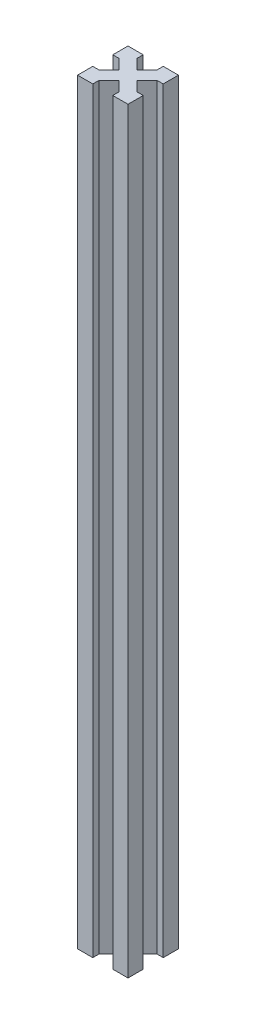
ISO-10303-21;
HEADER;
FILE_DESCRIPTION(('STEP AP214'),'2;1');
FILE_NAME('part.step','',(''),(''),'','','');
FILE_SCHEMA(('AUTOMOTIVE_DESIGN { 1 0 10303 214 1 1 1 1 }'));
ENDSEC;
DATA;
#1=APPLICATION_CONTEXT('core data for automotive mechanical design processes');
#2=APPLICATION_PROTOCOL_DEFINITION('international standard','automotive_design',2000,#1);
#3=PRODUCT_CONTEXT('',#1,'mechanical');
#4=PRODUCT('Part','Part','',(#3));
#5=PRODUCT_RELATED_PRODUCT_CATEGORY('part','',(#4));
#6=PRODUCT_DEFINITION_FORMATION('','',#4);
#7=PRODUCT_DEFINITION_CONTEXT('part definition',#1,'design');
#8=PRODUCT_DEFINITION('design','',#6,#7);
#9=PRODUCT_DEFINITION_SHAPE('','',#8);
#10=(LENGTH_UNIT() NAMED_UNIT(*) SI_UNIT(.MILLI.,.METRE.));
#11=(NAMED_UNIT(*) PLANE_ANGLE_UNIT() SI_UNIT($,.RADIAN.));
#12=(NAMED_UNIT(*) SI_UNIT($,.STERADIAN.) SOLID_ANGLE_UNIT());
#13=UNCERTAINTY_MEASURE_WITH_UNIT(LENGTH_MEASURE(1.E-05),#10,'distance_accuracy_value','');
#14=(GEOMETRIC_REPRESENTATION_CONTEXT(3) GLOBAL_UNCERTAINTY_ASSIGNED_CONTEXT((#13)) GLOBAL_UNIT_ASSIGNED_CONTEXT((#10,
#11,#12)) REPRESENTATION_CONTEXT('',''));
#15=CARTESIAN_POINT('',(0.,0.,0.));
#16=DIRECTION('',(0.,0.,1.));
#17=DIRECTION('',(1.,0.,0.));
#18=AXIS2_PLACEMENT_3D('',#15,#16,#17);
#19=CARTESIAN_POINT('',(-11.7677669529664,300.,-11.7677669529664));
#20=DIRECTION('',(0.707106781186548,0.,0.707106781186547));
#21=DIRECTION('',(0.707106781186547,0.,-0.707106781186548));
#22=AXIS2_PLACEMENT_3D('',#19,#20,#21);
#23=PLANE('',#22);
#24=DIRECTION('',(-0.707106781186547,0.,0.707106781186548));
#25=VECTOR('',#24,1.);
#26=CARTESIAN_POINT('',(-11.7677669529664,0.,-11.7677669529664));
#27=LINE('',#26,#25);
#28=CARTESIAN_POINT('',(-13.5355339059327,0.,-10.));
#29=VERTEX_POINT('',#28);
#30=CARTESIAN_POINT('',(-17.5,0.,-6.03553390593274));
#31=VERTEX_POINT('',#30);
#32=EDGE_CURVE('E226',#29,#31,#27,.T.);
#33=ORIENTED_EDGE('',*,*,#32,.T.);
#34=DIRECTION('',(0.,-1.,0.));
#35=VECTOR('',#34,1.);
#36=CARTESIAN_POINT('',(-17.5,300.,-6.03553390593274));
#37=LINE('',#36,#35);
#38=CARTESIAN_POINT('',(-17.5,300.,-6.03553390593274));
#39=VERTEX_POINT('',#38);
#40=EDGE_CURVE('E11',#39,#31,#37,.T.);
#41=ORIENTED_EDGE('',*,*,#40,.F.);
#42=DIRECTION('',(-0.707106781186547,0.,0.707106781186548));
#43=VECTOR('',#42,1.);
#44=CARTESIAN_POINT('',(-11.7677669529664,300.,-11.7677669529664));
#45=LINE('',#44,#43);
#46=CARTESIAN_POINT('',(-13.5355339059327,300.,-10.));
#47=VERTEX_POINT('',#46);
#48=EDGE_CURVE('E289',#47,#39,#45,.T.);
#49=ORIENTED_EDGE('',*,*,#48,.F.);
#50=DIRECTION('',(0.,-1.,0.));
#51=VECTOR('',#50,1.);
#52=CARTESIAN_POINT('',(-13.5355339059327,300.,-10.));
#53=LINE('',#52,#51);
#54=EDGE_CURVE('E222',#47,#29,#53,.T.);
#55=ORIENTED_EDGE('',*,*,#54,.T.);
#56=EDGE_LOOP('',(#33,#41,#49,#55));
#57=FACE_BOUND('',#56,.T.);
#58=ADVANCED_FACE('F36',(#57),#23,.F.);
#59=CARTESIAN_POINT('',(0.,300.,-6.03553390593273));
#60=DIRECTION('',(0.,0.,1.));
#61=DIRECTION('',(1.,0.,0.));
#62=AXIS2_PLACEMENT_3D('',#59,#60,#61);
#63=PLANE('',#62);
#64=DIRECTION('',(-1.,0.,0.));
#65=VECTOR('',#64,1.);
#66=CARTESIAN_POINT('',(0.,0.,-6.03553390593273));
#67=LINE('',#66,#65);
#68=CARTESIAN_POINT('',(-20.,0.,-6.03553390593273));
#69=VERTEX_POINT('',#68);
#70=EDGE_CURVE('E229',#31,#69,#67,.T.);
#71=ORIENTED_EDGE('',*,*,#70,.T.);
#72=DIRECTION('',(0.,-1.,0.));
#73=VECTOR('',#72,1.);
#74=CARTESIAN_POINT('',(-20.,300.,-6.03553390593273));
#75=LINE('',#74,#73);
#76=CARTESIAN_POINT('',(-20.,300.,-6.03553390593273));
#77=VERTEX_POINT('',#76);
#78=EDGE_CURVE('E44',#77,#69,#75,.T.);
#79=ORIENTED_EDGE('',*,*,#78,.F.);
#80=DIRECTION('',(-1.,0.,0.));
#81=VECTOR('',#80,1.);
#82=CARTESIAN_POINT('',(0.,300.,-6.03553390593273));
#83=LINE('',#82,#81);
#84=EDGE_CURVE('E139',#39,#77,#83,.T.);
#85=ORIENTED_EDGE('',*,*,#84,.F.);
#86=ORIENTED_EDGE('',*,*,#40,.T.);
#87=EDGE_LOOP('',(#71,#79,#85,#86));
#88=FACE_BOUND('',#87,.T.);
#89=ADVANCED_FACE('F338',(#88),#63,.F.);
#90=CARTESIAN_POINT('',(-20.,300.,0.));
#91=DIRECTION('',(-1.,0.,0.));
#92=DIRECTION('',(0.,0.,1.));
#93=AXIS2_PLACEMENT_3D('',#90,#91,#92);
#94=PLANE('',#93);
#95=DIRECTION('',(0.,0.,-1.));
#96=VECTOR('',#95,1.);
#97=CARTESIAN_POINT('',(-20.,0.,0.));
#98=LINE('',#97,#96);
#99=CARTESIAN_POINT('',(-20.,0.,0.));
#100=VERTEX_POINT('',#99);
#101=EDGE_CURVE('E232',#100,#69,#98,.T.);
#102=ORIENTED_EDGE('',*,*,#101,.F.);
#103=DIRECTION('',(0.,-1.,0.));
#104=VECTOR('',#103,1.);
#105=CARTESIAN_POINT('',(-20.,300.,0.));
#106=LINE('',#105,#104);
#107=CARTESIAN_POINT('',(-20.,300.,0.));
#108=VERTEX_POINT('',#107);
#109=EDGE_CURVE('E331',#108,#100,#106,.T.);
#110=ORIENTED_EDGE('',*,*,#109,.F.);
#111=DIRECTION('',(0.,0.,-1.));
#112=VECTOR('',#111,1.);
#113=CARTESIAN_POINT('',(-20.,300.,0.));
#114=LINE('',#113,#112);
#115=EDGE_CURVE('E337',#108,#77,#114,.T.);
#116=ORIENTED_EDGE('',*,*,#115,.T.);
#117=ORIENTED_EDGE('',*,*,#78,.T.);
#118=EDGE_LOOP('',(#102,#110,#116,#117));
#119=FACE_BOUND('',#118,.T.);
#120=ADVANCED_FACE('F335',(#119),#94,.T.);
#121=CARTESIAN_POINT('',(0.,300.,0.));
#122=DIRECTION('',(0.,0.,1.));
#123=DIRECTION('',(1.,0.,0.));
#124=AXIS2_PLACEMENT_3D('',#121,#122,#123);
#125=PLANE('',#124);
#126=DIRECTION('',(-1.,0.,0.));
#127=VECTOR('',#126,1.);
#128=CARTESIAN_POINT('',(0.,0.,0.));
#129=LINE('',#128,#127);
#130=CARTESIAN_POINT('',(-13.9644660940673,0.,0.));
#131=VERTEX_POINT('',#130);
#132=EDGE_CURVE('E235',#131,#100,#129,.T.);
#133=ORIENTED_EDGE('',*,*,#132,.F.);
#134=DIRECTION('',(0.,-1.,0.));
#135=VECTOR('',#134,1.);
#136=CARTESIAN_POINT('',(-13.9644660940673,300.,0.));
#137=LINE('',#136,#135);
#138=CARTESIAN_POINT('',(-13.9644660940673,300.,0.));
#139=VERTEX_POINT('',#138);
#140=EDGE_CURVE('E329',#139,#131,#137,.T.);
#141=ORIENTED_EDGE('',*,*,#140,.F.);
#142=DIRECTION('',(-1.,0.,0.));
#143=VECTOR('',#142,1.);
#144=CARTESIAN_POINT('',(0.,300.,0.));
#145=LINE('',#144,#143);
#146=EDGE_CURVE('E349',#139,#108,#145,.T.);
#147=ORIENTED_EDGE('',*,*,#146,.T.);
#148=ORIENTED_EDGE('',*,*,#109,.T.);
#149=EDGE_LOOP('',(#133,#141,#147,#148));
#150=FACE_BOUND('',#149,.T.);
#151=ADVANCED_FACE('F346',(#150),#125,.T.);
#152=CARTESIAN_POINT('',(-13.9644660940673,300.,0.));
#153=DIRECTION('',(1.,0.,0.));
#154=DIRECTION('',(0.,0.,-1.));
#155=AXIS2_PLACEMENT_3D('',#152,#153,#154);
#156=PLANE('',#155);
#157=DIRECTION('',(0.,0.,1.));
#158=VECTOR('',#157,1.);
#159=CARTESIAN_POINT('',(-13.9644660940673,0.,0.));
#160=LINE('',#159,#158);
#161=CARTESIAN_POINT('',(-13.9644660940673,0.,-2.5));
#162=VERTEX_POINT('',#161);
#163=EDGE_CURVE('E238',#162,#131,#160,.T.);
#164=ORIENTED_EDGE('',*,*,#163,.F.);
#165=DIRECTION('',(0.,-1.,0.));
#166=VECTOR('',#165,1.);
#167=CARTESIAN_POINT('',(-13.9644660940673,300.,-2.5));
#168=LINE('',#167,#166);
#169=CARTESIAN_POINT('',(-13.9644660940673,300.,-2.5));
#170=VERTEX_POINT('',#169);
#171=EDGE_CURVE('E327',#170,#162,#168,.T.);
#172=ORIENTED_EDGE('',*,*,#171,.F.);
#173=DIRECTION('',(0.,0.,1.));
#174=VECTOR('',#173,1.);
#175=CARTESIAN_POINT('',(-13.9644660940673,300.,0.));
#176=LINE('',#175,#174);
#177=EDGE_CURVE('E353',#170,#139,#176,.T.);
#178=ORIENTED_EDGE('',*,*,#177,.T.);
#179=ORIENTED_EDGE('',*,*,#140,.T.);
#180=EDGE_LOOP('',(#164,#172,#178,#179));
#181=FACE_BOUND('',#180,.T.);
#182=ADVANCED_FACE('F427',(#181),#156,.T.);
#183=CARTESIAN_POINT('',(-8.23223304703364,300.,-8.23223304703363));
#184=DIRECTION('',(0.707106781186548,0.,0.707106781186547));
#185=DIRECTION('',(0.707106781186547,0.,-0.707106781186548));
#186=AXIS2_PLACEMENT_3D('',#183,#184,#185);
#187=PLANE('',#186);
#188=DIRECTION('',(-0.707106781186547,0.,0.707106781186548));
#189=VECTOR('',#188,1.);
#190=CARTESIAN_POINT('',(-8.23223304703364,0.,-8.23223304703363));
#191=LINE('',#190,#189);
#192=CARTESIAN_POINT('',(-9.99999999999999,0.,-6.46446609406727));
#193=VERTEX_POINT('',#192);
#194=EDGE_CURVE('E241',#193,#162,#191,.T.);
#195=ORIENTED_EDGE('',*,*,#194,.F.);
#196=DIRECTION('',(0.,-1.,0.));
#197=VECTOR('',#196,1.);
#198=CARTESIAN_POINT('',(-9.99999999999999,300.,-6.46446609406727));
#199=LINE('',#198,#197);
#200=CARTESIAN_POINT('',(-9.99999999999999,300.,-6.46446609406727));
#201=VERTEX_POINT('',#200);
#202=EDGE_CURVE('E325',#201,#193,#199,.T.);
#203=ORIENTED_EDGE('',*,*,#202,.F.);
#204=DIRECTION('',(-0.707106781186547,0.,0.707106781186548));
#205=VECTOR('',#204,1.);
#206=CARTESIAN_POINT('',(-8.23223304703364,300.,-8.23223304703363));
#207=LINE('',#206,#205);
#208=EDGE_CURVE('E359',#201,#170,#207,.T.);
#209=ORIENTED_EDGE('',*,*,#208,.T.);
#210=ORIENTED_EDGE('',*,*,#171,.T.);
#211=EDGE_LOOP('',(#195,#203,#209,#210));
#212=FACE_BOUND('',#211,.T.);
#213=ADVANCED_FACE('F430',(#212),#187,.T.);
#214=CARTESIAN_POINT('',(-1.76776695296636,300.,1.76776695296636));
#215=DIRECTION('',(0.707106781186548,0.,-0.707106781186548));
#216=DIRECTION('',(-0.707106781186548,0.,-0.707106781186548));
#217=AXIS2_PLACEMENT_3D('',#214,#215,#216);
#218=PLANE('',#217);
#219=DIRECTION('',(0.707106781186548,0.,0.707106781186548));
#220=VECTOR('',#219,1.);
#221=CARTESIAN_POINT('',(-1.76776695296636,0.,1.76776695296636));
#222=LINE('',#221,#220);
#223=CARTESIAN_POINT('',(-6.03553390593273,0.,-2.5));
#224=VERTEX_POINT('',#223);
#225=EDGE_CURVE('E244',#193,#224,#222,.T.);
#226=ORIENTED_EDGE('',*,*,#225,.T.);
#227=DIRECTION('',(0.,-1.,0.));
#228=VECTOR('',#227,1.);
#229=CARTESIAN_POINT('',(-6.03553390593273,300.,-2.5));
#230=LINE('',#229,#228);
#231=CARTESIAN_POINT('',(-6.03553390593273,300.,-2.5));
#232=VERTEX_POINT('',#231);
#233=EDGE_CURVE('E322',#232,#224,#230,.T.);
#234=ORIENTED_EDGE('',*,*,#233,.F.);
#235=DIRECTION('',(0.707106781186548,0.,0.707106781186548));
#236=VECTOR('',#235,1.);
#237=CARTESIAN_POINT('',(-1.76776695296636,300.,1.76776695296636));
#238=LINE('',#237,#236);
#239=EDGE_CURVE('E362',#201,#232,#238,.T.);
#240=ORIENTED_EDGE('',*,*,#239,.F.);
#241=ORIENTED_EDGE('',*,*,#202,.T.);
#242=EDGE_LOOP('',(#226,#234,#240,#241));
#243=FACE_BOUND('',#242,.T.);
#244=ADVANCED_FACE('F434',(#243),#218,.F.);
#245=CARTESIAN_POINT('',(-6.03553390593273,300.,0.));
#246=DIRECTION('',(1.,0.,0.));
#247=DIRECTION('',(0.,0.,-1.));
#248=AXIS2_PLACEMENT_3D('',#245,#246,#247);
#249=PLANE('',#248);
#250=DIRECTION('',(0.,0.,1.));
#251=VECTOR('',#250,1.);
#252=CARTESIAN_POINT('',(-6.03553390593273,0.,0.));
#253=LINE('',#252,#251);
#254=CARTESIAN_POINT('',(-6.03553390593273,0.,0.));
#255=VERTEX_POINT('',#254);
#256=EDGE_CURVE('E246',#224,#255,#253,.T.);
#257=ORIENTED_EDGE('',*,*,#256,.T.);
#258=DIRECTION('',(0.,-1.,0.));
#259=VECTOR('',#258,1.);
#260=CARTESIAN_POINT('',(-6.03553390593273,300.,0.));
#261=LINE('',#260,#259);
#262=CARTESIAN_POINT('',(-6.03553390593273,300.,0.));
#263=VERTEX_POINT('',#262);
#264=EDGE_CURVE('E320',#263,#255,#261,.T.);
#265=ORIENTED_EDGE('',*,*,#264,.F.);
#266=DIRECTION('',(0.,0.,1.));
#267=VECTOR('',#266,1.);
#268=CARTESIAN_POINT('',(-6.03553390593273,300.,0.));
#269=LINE('',#268,#267);
#270=EDGE_CURVE('E364',#232,#263,#269,.T.);
#271=ORIENTED_EDGE('',*,*,#270,.F.);
#272=ORIENTED_EDGE('',*,*,#233,.T.);
#273=EDGE_LOOP('',(#257,#265,#271,#272));
#274=FACE_BOUND('',#273,.T.);
#275=ADVANCED_FACE('F438',(#274),#249,.F.);
#276=CARTESIAN_POINT('',(0.,300.,0.));
#277=DIRECTION('',(0.,0.,1.));
#278=DIRECTION('',(1.,0.,0.));
#279=AXIS2_PLACEMENT_3D('',#276,#277,#278);
#280=PLANE('',#279);
#281=DIRECTION('',(-1.,0.,0.));
#282=VECTOR('',#281,1.);
#283=CARTESIAN_POINT('',(0.,0.,0.));
#284=LINE('',#283,#282);
#285=CARTESIAN_POINT('',(0.,0.,0.));
#286=VERTEX_POINT('',#285);
#287=EDGE_CURVE('E249',#286,#255,#284,.T.);
#288=ORIENTED_EDGE('',*,*,#287,.F.);
#289=DIRECTION('',(0.,-1.,0.));
#290=VECTOR('',#289,1.);
#291=CARTESIAN_POINT('',(0.,300.,0.));
#292=LINE('',#291,#290);
#293=CARTESIAN_POINT('',(0.,300.,0.));
#294=VERTEX_POINT('',#293);
#295=EDGE_CURVE('E318',#294,#286,#292,.T.);
#296=ORIENTED_EDGE('',*,*,#295,.F.);
#297=DIRECTION('',(-1.,0.,0.));
#298=VECTOR('',#297,1.);
#299=CARTESIAN_POINT('',(0.,300.,0.));
#300=LINE('',#299,#298);
#301=EDGE_CURVE('E366',#294,#263,#300,.T.);
#302=ORIENTED_EDGE('',*,*,#301,.T.);
#303=ORIENTED_EDGE('',*,*,#264,.T.);
#304=EDGE_LOOP('',(#288,#296,#302,#303));
#305=FACE_BOUND('',#304,.T.);
#306=ADVANCED_FACE('F442',(#305),#280,.T.);
#307=CARTESIAN_POINT('',(0.,300.,0.));
#308=DIRECTION('',(-1.,0.,0.));
#309=DIRECTION('',(0.,0.,1.));
#310=AXIS2_PLACEMENT_3D('',#307,#308,#309);
#311=PLANE('',#310);
#312=DIRECTION('',(0.,0.,-1.));
#313=VECTOR('',#312,1.);
#314=CARTESIAN_POINT('',(0.,0.,0.));
#315=LINE('',#314,#313);
#316=CARTESIAN_POINT('',(0.,0.,-6.03553390593273));
#317=VERTEX_POINT('',#316);
#318=EDGE_CURVE('E252',#286,#317,#315,.T.);
#319=ORIENTED_EDGE('',*,*,#318,.T.);
#320=DIRECTION('',(0.,-1.,0.));
#321=VECTOR('',#320,1.);
#322=CARTESIAN_POINT('',(0.,300.,-6.03553390593273));
#323=LINE('',#322,#321);
#324=CARTESIAN_POINT('',(0.,300.,-6.03553390593273));
#325=VERTEX_POINT('',#324);
#326=EDGE_CURVE('E316',#325,#317,#323,.T.);
#327=ORIENTED_EDGE('',*,*,#326,.F.);
#328=DIRECTION('',(0.,0.,-1.));
#329=VECTOR('',#328,1.);
#330=CARTESIAN_POINT('',(0.,300.,0.));
#331=LINE('',#330,#329);
#332=EDGE_CURVE('E369',#294,#325,#331,.T.);
#333=ORIENTED_EDGE('',*,*,#332,.F.);
#334=ORIENTED_EDGE('',*,*,#295,.T.);
#335=EDGE_LOOP('',(#319,#327,#333,#334));
#336=FACE_BOUND('',#335,.T.);
#337=ADVANCED_FACE('F446',(#336),#311,.F.);
#338=CARTESIAN_POINT('',(0.,300.,-6.03553390593273));
#339=DIRECTION('',(0.,0.,-1.));
#340=DIRECTION('',(-1.,0.,0.));
#341=AXIS2_PLACEMENT_3D('',#338,#339,#340);
#342=PLANE('',#341);
#343=DIRECTION('',(1.,0.,0.));
#344=VECTOR('',#343,1.);
#345=CARTESIAN_POINT('',(0.,0.,-6.03553390593273));
#346=LINE('',#345,#344);
#347=CARTESIAN_POINT('',(-2.5,0.,-6.03553390593274));
#348=VERTEX_POINT('',#347);
#349=EDGE_CURVE('E255',#348,#317,#346,.T.);
#350=ORIENTED_EDGE('',*,*,#349,.F.);
#351=DIRECTION('',(0.,-1.,0.));
#352=VECTOR('',#351,1.);
#353=CARTESIAN_POINT('',(-2.5,300.,-6.03553390593274));
#354=LINE('',#353,#352);
#355=CARTESIAN_POINT('',(-2.5,300.,-6.03553390593274));
#356=VERTEX_POINT('',#355);
#357=EDGE_CURVE('E314',#356,#348,#354,.T.);
#358=ORIENTED_EDGE('',*,*,#357,.F.);
#359=DIRECTION('',(1.,0.,0.));
#360=VECTOR('',#359,1.);
#361=CARTESIAN_POINT('',(0.,300.,-6.03553390593273));
#362=LINE('',#361,#360);
#363=EDGE_CURVE('E371',#356,#325,#362,.T.);
#364=ORIENTED_EDGE('',*,*,#363,.T.);
#365=ORIENTED_EDGE('',*,*,#326,.T.);
#366=EDGE_LOOP('',(#350,#358,#364,#365));
#367=FACE_BOUND('',#366,.T.);
#368=ADVANCED_FACE('F450',(#367),#342,.T.);
#369=CARTESIAN_POINT('',(1.76776695296637,300.,-1.76776695296637));
#370=DIRECTION('',(0.707106781186548,0.,-0.707106781186548));
#371=DIRECTION('',(-0.707106781186548,0.,-0.707106781186548));
#372=AXIS2_PLACEMENT_3D('',#369,#370,#371);
#373=PLANE('',#372);
#374=DIRECTION('',(0.707106781186548,0.,0.707106781186548));
#375=VECTOR('',#374,1.);
#376=CARTESIAN_POINT('',(1.76776695296637,0.,-1.76776695296637));
#377=LINE('',#376,#375);
#378=CARTESIAN_POINT('',(-6.46446609406727,0.,-10.));
#379=VERTEX_POINT('',#378);
#380=EDGE_CURVE('E258',#379,#348,#377,.T.);
#381=ORIENTED_EDGE('',*,*,#380,.F.);
#382=DIRECTION('',(0.,-1.,0.));
#383=VECTOR('',#382,1.);
#384=CARTESIAN_POINT('',(-6.46446609406727,300.,-10.));
#385=LINE('',#384,#383);
#386=CARTESIAN_POINT('',(-6.46446609406727,300.,-10.));
#387=VERTEX_POINT('',#386);
#388=EDGE_CURVE('E312',#387,#379,#385,.T.);
#389=ORIENTED_EDGE('',*,*,#388,.F.);
#390=DIRECTION('',(0.707106781186548,0.,0.707106781186548));
#391=VECTOR('',#390,1.);
#392=CARTESIAN_POINT('',(1.76776695296637,300.,-1.76776695296637));
#393=LINE('',#392,#391);
#394=EDGE_CURVE('E374',#387,#356,#393,.T.);
#395=ORIENTED_EDGE('',*,*,#394,.T.);
#396=ORIENTED_EDGE('',*,*,#357,.T.);
#397=EDGE_LOOP('',(#381,#389,#395,#396));
#398=FACE_BOUND('',#397,.T.);
#399=ADVANCED_FACE('F454',(#398),#373,.T.);
#400=CARTESIAN_POINT('',(-8.23223304703364,300.,-8.23223304703363));
#401=DIRECTION('',(0.707106781186548,0.,0.707106781186547));
#402=DIRECTION('',(0.707106781186547,0.,-0.707106781186548));
#403=AXIS2_PLACEMENT_3D('',#400,#401,#402);
#404=PLANE('',#403);
#405=DIRECTION('',(-0.707106781186547,0.,0.707106781186548));
#406=VECTOR('',#405,1.);
#407=CARTESIAN_POINT('',(-8.23223304703364,0.,-8.23223304703363));
#408=LINE('',#407,#406);
#409=CARTESIAN_POINT('',(-2.50000000000001,0.,-13.9644660940673));
#410=VERTEX_POINT('',#409);
#411=EDGE_CURVE('E261',#410,#379,#408,.T.);
#412=ORIENTED_EDGE('',*,*,#411,.F.);
#413=DIRECTION('',(0.,-1.,0.));
#414=VECTOR('',#413,1.);
#415=CARTESIAN_POINT('',(-2.50000000000001,300.,-13.9644660940673));
#416=LINE('',#415,#414);
#417=CARTESIAN_POINT('',(-2.50000000000001,300.,-13.9644660940673));
#418=VERTEX_POINT('',#417);
#419=EDGE_CURVE('E310',#418,#410,#416,.T.);
#420=ORIENTED_EDGE('',*,*,#419,.F.);
#421=DIRECTION('',(-0.707106781186547,0.,0.707106781186548));
#422=VECTOR('',#421,1.);
#423=CARTESIAN_POINT('',(-8.23223304703364,300.,-8.23223304703363));
#424=LINE('',#423,#422);
#425=EDGE_CURVE('E377',#418,#387,#424,.T.);
#426=ORIENTED_EDGE('',*,*,#425,.T.);
#427=ORIENTED_EDGE('',*,*,#388,.T.);
#428=EDGE_LOOP('',(#412,#420,#426,#427));
#429=FACE_BOUND('',#428,.T.);
#430=ADVANCED_FACE('F458',(#429),#404,.T.);
#431=CARTESIAN_POINT('',(0.,300.,-13.9644660940673));
#432=DIRECTION('',(0.,0.,-1.));
#433=DIRECTION('',(-1.,0.,0.));
#434=AXIS2_PLACEMENT_3D('',#431,#432,#433);
#435=PLANE('',#434);
#436=DIRECTION('',(1.,0.,0.));
#437=VECTOR('',#436,1.);
#438=CARTESIAN_POINT('',(0.,0.,-13.9644660940673));
#439=LINE('',#438,#437);
#440=CARTESIAN_POINT('',(0.,0.,-13.9644660940673));
#441=VERTEX_POINT('',#440);
#442=EDGE_CURVE('E264',#410,#441,#439,.T.);
#443=ORIENTED_EDGE('',*,*,#442,.T.);
#444=DIRECTION('',(0.,-1.,0.));
#445=VECTOR('',#444,1.);
#446=CARTESIAN_POINT('',(0.,300.,-13.9644660940673));
#447=LINE('',#446,#445);
#448=CARTESIAN_POINT('',(0.,300.,-13.9644660940673));
#449=VERTEX_POINT('',#448);
#450=EDGE_CURVE('E307',#449,#441,#447,.T.);
#451=ORIENTED_EDGE('',*,*,#450,.F.);
#452=DIRECTION('',(1.,0.,0.));
#453=VECTOR('',#452,1.);
#454=CARTESIAN_POINT('',(0.,300.,-13.9644660940673));
#455=LINE('',#454,#453);
#456=EDGE_CURVE('E380',#418,#449,#455,.T.);
#457=ORIENTED_EDGE('',*,*,#456,.F.);
#458=ORIENTED_EDGE('',*,*,#419,.T.);
#459=EDGE_LOOP('',(#443,#451,#457,#458));
#460=FACE_BOUND('',#459,.T.);
#461=ADVANCED_FACE('F462',(#460),#435,.F.);
#462=CARTESIAN_POINT('',(0.,300.,0.));
#463=DIRECTION('',(-1.,0.,0.));
#464=DIRECTION('',(0.,0.,1.));
#465=AXIS2_PLACEMENT_3D('',#462,#463,#464);
#466=PLANE('',#465);
#467=DIRECTION('',(0.,0.,-1.));
#468=VECTOR('',#467,1.);
#469=CARTESIAN_POINT('',(0.,0.,0.));
#470=LINE('',#469,#468);
#471=CARTESIAN_POINT('',(0.,0.,-20.));
#472=VERTEX_POINT('',#471);
#473=EDGE_CURVE('E266',#441,#472,#470,.T.);
#474=ORIENTED_EDGE('',*,*,#473,.T.);
#475=DIRECTION('',(0.,-1.,0.));
#476=VECTOR('',#475,1.);
#477=CARTESIAN_POINT('',(0.,300.,-20.));
#478=LINE('',#477,#476);
#479=CARTESIAN_POINT('',(0.,300.,-20.));
#480=VERTEX_POINT('',#479);
#481=EDGE_CURVE('E304',#480,#472,#478,.T.);
#482=ORIENTED_EDGE('',*,*,#481,.F.);
#483=DIRECTION('',(0.,0.,-1.));
#484=VECTOR('',#483,1.);
#485=CARTESIAN_POINT('',(0.,300.,0.));
#486=LINE('',#485,#484);
#487=EDGE_CURVE('E382',#449,#480,#486,.T.);
#488=ORIENTED_EDGE('',*,*,#487,.F.);
#489=ORIENTED_EDGE('',*,*,#450,.T.);
#490=EDGE_LOOP('',(#474,#482,#488,#489));
#491=FACE_BOUND('',#490,.T.);
#492=ADVANCED_FACE('F466',(#491),#466,.F.);
#493=CARTESIAN_POINT('',(0.,300.,-20.));
#494=DIRECTION('',(0.,0.,1.));
#495=DIRECTION('',(1.,0.,0.));
#496=AXIS2_PLACEMENT_3D('',#493,#494,#495);
#497=PLANE('',#496);
#498=DIRECTION('',(-1.,0.,0.));
#499=VECTOR('',#498,1.);
#500=CARTESIAN_POINT('',(0.,0.,-20.));
#501=LINE('',#500,#499);
#502=CARTESIAN_POINT('',(-6.03553390593273,0.,-20.));
#503=VERTEX_POINT('',#502);
#504=EDGE_CURVE('E268',#472,#503,#501,.T.);
#505=ORIENTED_EDGE('',*,*,#504,.T.);
#506=DIRECTION('',(0.,-1.,0.));
#507=VECTOR('',#506,1.);
#508=CARTESIAN_POINT('',(-6.03553390593273,300.,-20.));
#509=LINE('',#508,#507);
#510=CARTESIAN_POINT('',(-6.03553390593273,300.,-20.));
#511=VERTEX_POINT('',#510);
#512=EDGE_CURVE('E302',#511,#503,#509,.T.);
#513=ORIENTED_EDGE('',*,*,#512,.F.);
#514=DIRECTION('',(-1.,0.,0.));
#515=VECTOR('',#514,1.);
#516=CARTESIAN_POINT('',(0.,300.,-20.));
#517=LINE('',#516,#515);
#518=EDGE_CURVE('E384',#480,#511,#517,.T.);
#519=ORIENTED_EDGE('',*,*,#518,.F.);
#520=ORIENTED_EDGE('',*,*,#481,.T.);
#521=EDGE_LOOP('',(#505,#513,#519,#520));
#522=FACE_BOUND('',#521,.T.);
#523=ADVANCED_FACE('F470',(#522),#497,.F.);
#524=CARTESIAN_POINT('',(-6.03553390593271,300.,0.));
#525=DIRECTION('',(-1.,0.,0.));
#526=DIRECTION('',(0.,0.,1.));
#527=AXIS2_PLACEMENT_3D('',#524,#525,#526);
#528=PLANE('',#527);
#529=DIRECTION('',(0.,0.,-1.));
#530=VECTOR('',#529,1.);
#531=CARTESIAN_POINT('',(-6.03553390593271,0.,0.));
#532=LINE('',#531,#530);
#533=CARTESIAN_POINT('',(-6.03553390593274,0.,-17.5));
#534=VERTEX_POINT('',#533);
#535=EDGE_CURVE('E271',#534,#503,#532,.T.);
#536=ORIENTED_EDGE('',*,*,#535,.F.);
#537=DIRECTION('',(0.,-1.,0.));
#538=VECTOR('',#537,1.);
#539=CARTESIAN_POINT('',(-6.03553390593274,300.,-17.5));
#540=LINE('',#539,#538);
#541=CARTESIAN_POINT('',(-6.03553390593274,300.,-17.5));
#542=VERTEX_POINT('',#541);
#543=EDGE_CURVE('E300',#542,#534,#540,.T.);
#544=ORIENTED_EDGE('',*,*,#543,.F.);
#545=DIRECTION('',(0.,0.,-1.));
#546=VECTOR('',#545,1.);
#547=CARTESIAN_POINT('',(-6.03553390593271,300.,0.));
#548=LINE('',#547,#546);
#549=EDGE_CURVE('E386',#542,#511,#548,.T.);
#550=ORIENTED_EDGE('',*,*,#549,.T.);
#551=ORIENTED_EDGE('',*,*,#512,.T.);
#552=EDGE_LOOP('',(#536,#544,#550,#551));
#553=FACE_BOUND('',#552,.T.);
#554=ADVANCED_FACE('F474',(#553),#528,.T.);
#555=CARTESIAN_POINT('',(-11.7677669529664,300.,-11.7677669529664));
#556=DIRECTION('',(0.707106781186548,0.,0.707106781186547));
#557=DIRECTION('',(0.707106781186547,0.,-0.707106781186548));
#558=AXIS2_PLACEMENT_3D('',#555,#556,#557);
#559=PLANE('',#558);
#560=DIRECTION('',(-0.707106781186547,0.,0.707106781186548));
#561=VECTOR('',#560,1.);
#562=CARTESIAN_POINT('',(-11.7677669529664,0.,-11.7677669529664));
#563=LINE('',#562,#561);
#564=CARTESIAN_POINT('',(-10.,0.,-13.5355339059327));
#565=VERTEX_POINT('',#564);
#566=EDGE_CURVE('E274',#534,#565,#563,.T.);
#567=ORIENTED_EDGE('',*,*,#566,.T.);
#568=DIRECTION('',(0.,-1.,0.));
#569=VECTOR('',#568,1.);
#570=CARTESIAN_POINT('',(-10.,300.,-13.5355339059327));
#571=LINE('',#570,#569);
#572=CARTESIAN_POINT('',(-10.,300.,-13.5355339059327));
#573=VERTEX_POINT('',#572);
#574=EDGE_CURVE('E298',#573,#565,#571,.T.);
#575=ORIENTED_EDGE('',*,*,#574,.F.);
#576=DIRECTION('',(-0.707106781186547,0.,0.707106781186548));
#577=VECTOR('',#576,1.);
#578=CARTESIAN_POINT('',(-11.7677669529664,300.,-11.7677669529664));
#579=LINE('',#578,#577);
#580=EDGE_CURVE('E389',#542,#573,#579,.T.);
#581=ORIENTED_EDGE('',*,*,#580,.F.);
#582=ORIENTED_EDGE('',*,*,#543,.T.);
#583=EDGE_LOOP('',(#567,#575,#581,#582));
#584=FACE_BOUND('',#583,.T.);
#585=ADVANCED_FACE('F478',(#584),#559,.F.);
#586=CARTESIAN_POINT('',(1.76776695296637,300.,-1.76776695296637));
#587=DIRECTION('',(0.707106781186548,0.,-0.707106781186548));
#588=DIRECTION('',(-0.707106781186548,0.,-0.707106781186548));
#589=AXIS2_PLACEMENT_3D('',#586,#587,#588);
#590=PLANE('',#589);
#591=DIRECTION('',(0.707106781186548,0.,0.707106781186548));
#592=VECTOR('',#591,1.);
#593=CARTESIAN_POINT('',(1.76776695296637,0.,-1.76776695296637));
#594=LINE('',#593,#592);
#595=CARTESIAN_POINT('',(-13.9644660940673,0.,-17.5));
#596=VERTEX_POINT('',#595);
#597=EDGE_CURVE('E277',#596,#565,#594,.T.);
#598=ORIENTED_EDGE('',*,*,#597,.F.);
#599=DIRECTION('',(0.,-1.,0.));
#600=VECTOR('',#599,1.);
#601=CARTESIAN_POINT('',(-13.9644660940673,300.,-17.5));
#602=LINE('',#601,#600);
#603=CARTESIAN_POINT('',(-13.9644660940673,300.,-17.5));
#604=VERTEX_POINT('',#603);
#605=EDGE_CURVE('E296',#604,#596,#602,.T.);
#606=ORIENTED_EDGE('',*,*,#605,.F.);
#607=DIRECTION('',(0.707106781186548,0.,0.707106781186548));
#608=VECTOR('',#607,1.);
#609=CARTESIAN_POINT('',(1.76776695296637,300.,-1.76776695296637));
#610=LINE('',#609,#608);
#611=EDGE_CURVE('E391',#604,#573,#610,.T.);
#612=ORIENTED_EDGE('',*,*,#611,.T.);
#613=ORIENTED_EDGE('',*,*,#574,.T.);
#614=EDGE_LOOP('',(#598,#606,#612,#613));
#615=FACE_BOUND('',#614,.T.);
#616=ADVANCED_FACE('F482',(#615),#590,.T.);
#617=CARTESIAN_POINT('',(-13.9644660940673,300.,0.));
#618=DIRECTION('',(-1.,0.,0.));
#619=DIRECTION('',(0.,0.,1.));
#620=AXIS2_PLACEMENT_3D('',#617,#618,#619);
#621=PLANE('',#620);
#622=DIRECTION('',(0.,0.,-1.));
#623=VECTOR('',#622,1.);
#624=CARTESIAN_POINT('',(-13.9644660940673,0.,0.));
#625=LINE('',#624,#623);
#626=CARTESIAN_POINT('',(-13.9644660940673,0.,-20.));
#627=VERTEX_POINT('',#626);
#628=EDGE_CURVE('E280',#596,#627,#625,.T.);
#629=ORIENTED_EDGE('',*,*,#628,.T.);
#630=DIRECTION('',(0.,-1.,0.));
#631=VECTOR('',#630,1.);
#632=CARTESIAN_POINT('',(-13.9644660940673,300.,-20.));
#633=LINE('',#632,#631);
#634=CARTESIAN_POINT('',(-13.9644660940673,300.,-20.));
#635=VERTEX_POINT('',#634);
#636=EDGE_CURVE('E293',#635,#627,#633,.T.);
#637=ORIENTED_EDGE('',*,*,#636,.F.);
#638=DIRECTION('',(0.,0.,-1.));
#639=VECTOR('',#638,1.);
#640=CARTESIAN_POINT('',(-13.9644660940673,300.,0.));
#641=LINE('',#640,#639);
#642=EDGE_CURVE('E394',#604,#635,#641,.T.);
#643=ORIENTED_EDGE('',*,*,#642,.F.);
#644=ORIENTED_EDGE('',*,*,#605,.T.);
#645=EDGE_LOOP('',(#629,#637,#643,#644));
#646=FACE_BOUND('',#645,.T.);
#647=ADVANCED_FACE('F399',(#646),#621,.F.);
#648=CARTESIAN_POINT('',(0.,300.,-20.));
#649=DIRECTION('',(0.,0.,1.));
#650=DIRECTION('',(1.,0.,0.));
#651=AXIS2_PLACEMENT_3D('',#648,#649,#650);
#652=PLANE('',#651);
#653=DIRECTION('',(-1.,0.,0.));
#654=VECTOR('',#653,1.);
#655=CARTESIAN_POINT('',(0.,0.,-20.));
#656=LINE('',#655,#654);
#657=CARTESIAN_POINT('',(-20.,0.,-20.));
#658=VERTEX_POINT('',#657);
#659=EDGE_CURVE('E282',#627,#658,#656,.T.);
#660=ORIENTED_EDGE('',*,*,#659,.T.);
#661=DIRECTION('',(0.,-1.,0.));
#662=VECTOR('',#661,1.);
#663=CARTESIAN_POINT('',(-20.,300.,-20.));
#664=LINE('',#663,#662);
#665=CARTESIAN_POINT('',(-20.,300.,-20.));
#666=VERTEX_POINT('',#665);
#667=EDGE_CURVE('E212',#666,#658,#664,.T.);
#668=ORIENTED_EDGE('',*,*,#667,.F.);
#669=DIRECTION('',(-1.,0.,0.));
#670=VECTOR('',#669,1.);
#671=CARTESIAN_POINT('',(0.,300.,-20.));
#672=LINE('',#671,#670);
#673=EDGE_CURVE('E217',#635,#666,#672,.T.);
#674=ORIENTED_EDGE('',*,*,#673,.F.);
#675=ORIENTED_EDGE('',*,*,#636,.T.);
#676=EDGE_LOOP('',(#660,#668,#674,#675));
#677=FACE_BOUND('',#676,.T.);
#678=ADVANCED_FACE('F403',(#677),#652,.F.);
#679=CARTESIAN_POINT('',(-20.,300.,0.));
#680=DIRECTION('',(-1.,0.,0.));
#681=DIRECTION('',(0.,0.,1.));
#682=AXIS2_PLACEMENT_3D('',#679,#680,#681);
#683=PLANE('',#682);
#684=DIRECTION('',(0.,0.,-1.));
#685=VECTOR('',#684,1.);
#686=CARTESIAN_POINT('',(-20.,0.,0.));
#687=LINE('',#686,#685);
#688=CARTESIAN_POINT('',(-20.,0.,-13.9644660940673));
#689=VERTEX_POINT('',#688);
#690=EDGE_CURVE('E207',#689,#658,#687,.T.);
#691=ORIENTED_EDGE('',*,*,#690,.F.);
#692=DIRECTION('',(0.,-1.,0.));
#693=VECTOR('',#692,1.);
#694=CARTESIAN_POINT('',(-20.,300.,-13.9644660940673));
#695=LINE('',#694,#693);
#696=CARTESIAN_POINT('',(-20.,300.,-13.9644660940673));
#697=VERTEX_POINT('',#696);
#698=EDGE_CURVE('E202',#697,#689,#695,.T.);
#699=ORIENTED_EDGE('',*,*,#698,.F.);
#700=DIRECTION('',(0.,0.,-1.));
#701=VECTOR('',#700,1.);
#702=CARTESIAN_POINT('',(-20.,300.,0.));
#703=LINE('',#702,#701);
#704=EDGE_CURVE('E205',#697,#666,#703,.T.);
#705=ORIENTED_EDGE('',*,*,#704,.T.);
#706=ORIENTED_EDGE('',*,*,#667,.T.);
#707=EDGE_LOOP('',(#691,#699,#705,#706));
#708=FACE_BOUND('',#707,.T.);
#709=ADVANCED_FACE('F204',(#708),#683,.T.);
#710=CARTESIAN_POINT('',(0.,300.,-13.9644660940673));
#711=DIRECTION('',(0.,0.,1.));
#712=DIRECTION('',(1.,0.,0.));
#713=AXIS2_PLACEMENT_3D('',#710,#711,#712);
#714=PLANE('',#713);
#715=DIRECTION('',(-1.,0.,0.));
#716=VECTOR('',#715,1.);
#717=CARTESIAN_POINT('',(0.,0.,-13.9644660940673));
#718=LINE('',#717,#716);
#719=CARTESIAN_POINT('',(-17.5,0.,-13.9644660940673));
#720=VERTEX_POINT('',#719);
#721=EDGE_CURVE('E286',#720,#689,#718,.T.);
#722=ORIENTED_EDGE('',*,*,#721,.F.);
#723=DIRECTION('',(0.,-1.,0.));
#724=VECTOR('',#723,1.);
#725=CARTESIAN_POINT('',(-17.5,300.,-13.9644660940673));
#726=LINE('',#725,#724);
#727=CARTESIAN_POINT('',(-17.5,300.,-13.9644660940673));
#728=VERTEX_POINT('',#727);
#729=EDGE_CURVE('E128',#728,#720,#726,.T.);
#730=ORIENTED_EDGE('',*,*,#729,.F.);
#731=DIRECTION('',(-1.,0.,0.));
#732=VECTOR('',#731,1.);
#733=CARTESIAN_POINT('',(0.,300.,-13.9644660940673));
#734=LINE('',#733,#732);
#735=EDGE_CURVE('E215',#728,#697,#734,.T.);
#736=ORIENTED_EDGE('',*,*,#735,.T.);
#737=ORIENTED_EDGE('',*,*,#698,.T.);
#738=EDGE_LOOP('',(#722,#730,#736,#737));
#739=FACE_BOUND('',#738,.T.);
#740=ADVANCED_FACE('F220',(#739),#714,.T.);
#741=CARTESIAN_POINT('',(-1.76776695296636,300.,1.76776695296636));
#742=DIRECTION('',(0.707106781186548,0.,-0.707106781186548));
#743=DIRECTION('',(-0.707106781186548,0.,-0.707106781186548));
#744=AXIS2_PLACEMENT_3D('',#741,#742,#743);
#745=PLANE('',#744);
#746=DIRECTION('',(0.707106781186548,0.,0.707106781186548));
#747=VECTOR('',#746,1.);
#748=CARTESIAN_POINT('',(-1.76776695296636,0.,1.76776695296636));
#749=LINE('',#748,#747);
#750=EDGE_CURVE('E131',#720,#29,#749,.T.);
#751=ORIENTED_EDGE('',*,*,#750,.T.);
#752=ORIENTED_EDGE('',*,*,#54,.F.);
#753=DIRECTION('',(0.707106781186548,0.,0.707106781186548));
#754=VECTOR('',#753,1.);
#755=CARTESIAN_POINT('',(-1.76776695296636,300.,1.76776695296636));
#756=LINE('',#755,#754);
#757=EDGE_CURVE('E52',#728,#47,#756,.T.);
#758=ORIENTED_EDGE('',*,*,#757,.F.);
#759=ORIENTED_EDGE('',*,*,#729,.T.);
#760=EDGE_LOOP('',(#751,#752,#758,#759));
#761=FACE_BOUND('',#760,.T.);
#762=ADVANCED_FACE('F406',(#761),#745,.F.);
#763=CARTESIAN_POINT('',(0.,300.,0.));
#764=DIRECTION('',(0.,1.,0.));
#765=DIRECTION('',(0.,0.,1.));
#766=AXIS2_PLACEMENT_3D('',#763,#764,#765);
#767=PLANE('',#766);
#768=ORIENTED_EDGE('',*,*,#48,.T.);
#769=ORIENTED_EDGE('',*,*,#84,.T.);
#770=ORIENTED_EDGE('',*,*,#115,.F.);
#771=ORIENTED_EDGE('',*,*,#146,.F.);
#772=ORIENTED_EDGE('',*,*,#177,.F.);
#773=ORIENTED_EDGE('',*,*,#208,.F.);
#774=ORIENTED_EDGE('',*,*,#239,.T.);
#775=ORIENTED_EDGE('',*,*,#270,.T.);
#776=ORIENTED_EDGE('',*,*,#301,.F.);
#777=ORIENTED_EDGE('',*,*,#332,.T.);
#778=ORIENTED_EDGE('',*,*,#363,.F.);
#779=ORIENTED_EDGE('',*,*,#394,.F.);
#780=ORIENTED_EDGE('',*,*,#425,.F.);
#781=ORIENTED_EDGE('',*,*,#456,.T.);
#782=ORIENTED_EDGE('',*,*,#487,.T.);
#783=ORIENTED_EDGE('',*,*,#518,.T.);
#784=ORIENTED_EDGE('',*,*,#549,.F.);
#785=ORIENTED_EDGE('',*,*,#580,.T.);
#786=ORIENTED_EDGE('',*,*,#611,.F.);
#787=ORIENTED_EDGE('',*,*,#642,.T.);
#788=ORIENTED_EDGE('',*,*,#673,.T.);
#789=ORIENTED_EDGE('',*,*,#704,.F.);
#790=ORIENTED_EDGE('',*,*,#735,.F.);
#791=ORIENTED_EDGE('',*,*,#757,.T.);
#792=EDGE_LOOP('',(#768,#769,#770,#771,#772,#773,#774,#775,#776,#777,#778,#779,#780,#781,#782,
#783,#784,#785,#786,#787,#788,#789,#790,#791));
#793=FACE_BOUND('',#792,.T.);
#794=ADVANCED_FACE('F214',(#793),#767,.T.);
#795=CARTESIAN_POINT('',(0.,0.,0.));
#796=DIRECTION('',(0.,1.,0.));
#797=DIRECTION('',(0.,0.,1.));
#798=AXIS2_PLACEMENT_3D('',#795,#796,#797);
#799=PLANE('',#798);
#800=ORIENTED_EDGE('',*,*,#32,.F.);
#801=ORIENTED_EDGE('',*,*,#750,.F.);
#802=ORIENTED_EDGE('',*,*,#721,.T.);
#803=ORIENTED_EDGE('',*,*,#690,.T.);
#804=ORIENTED_EDGE('',*,*,#659,.F.);
#805=ORIENTED_EDGE('',*,*,#628,.F.);
#806=ORIENTED_EDGE('',*,*,#597,.T.);
#807=ORIENTED_EDGE('',*,*,#566,.F.);
#808=ORIENTED_EDGE('',*,*,#535,.T.);
#809=ORIENTED_EDGE('',*,*,#504,.F.);
#810=ORIENTED_EDGE('',*,*,#473,.F.);
#811=ORIENTED_EDGE('',*,*,#442,.F.);
#812=ORIENTED_EDGE('',*,*,#411,.T.);
#813=ORIENTED_EDGE('',*,*,#380,.T.);
#814=ORIENTED_EDGE('',*,*,#349,.T.);
#815=ORIENTED_EDGE('',*,*,#318,.F.);
#816=ORIENTED_EDGE('',*,*,#287,.T.);
#817=ORIENTED_EDGE('',*,*,#256,.F.);
#818=ORIENTED_EDGE('',*,*,#225,.F.);
#819=ORIENTED_EDGE('',*,*,#194,.T.);
#820=ORIENTED_EDGE('',*,*,#163,.T.);
#821=ORIENTED_EDGE('',*,*,#132,.T.);
#822=ORIENTED_EDGE('',*,*,#101,.T.);
#823=ORIENTED_EDGE('',*,*,#70,.F.);
#824=EDGE_LOOP('',(#800,#801,#802,#803,#804,#805,#806,#807,#808,#809,#810,#811,#812,#813,#814,
#815,#816,#817,#818,#819,#820,#821,#822,#823));
#825=FACE_BOUND('',#824,.T.);
#826=ADVANCED_FACE('F342',(#825),#799,.F.);
#827=CLOSED_SHELL('',(#58,#89,#120,#151,#182,#213,#244,#275,#306,#337,#368,#399,#430,#461,#492,
#523,#554,#585,#616,#647,#678,#709,#740,#762,#794,#826));
#828=MANIFOLD_SOLID_BREP('B2',#827);
#829=ADVANCED_BREP_SHAPE_REPRESENTATION('',(#18,#828),#14);
#830=SHAPE_DEFINITION_REPRESENTATION(#9,#829);
ENDSEC;
END-ISO-10303-21;
